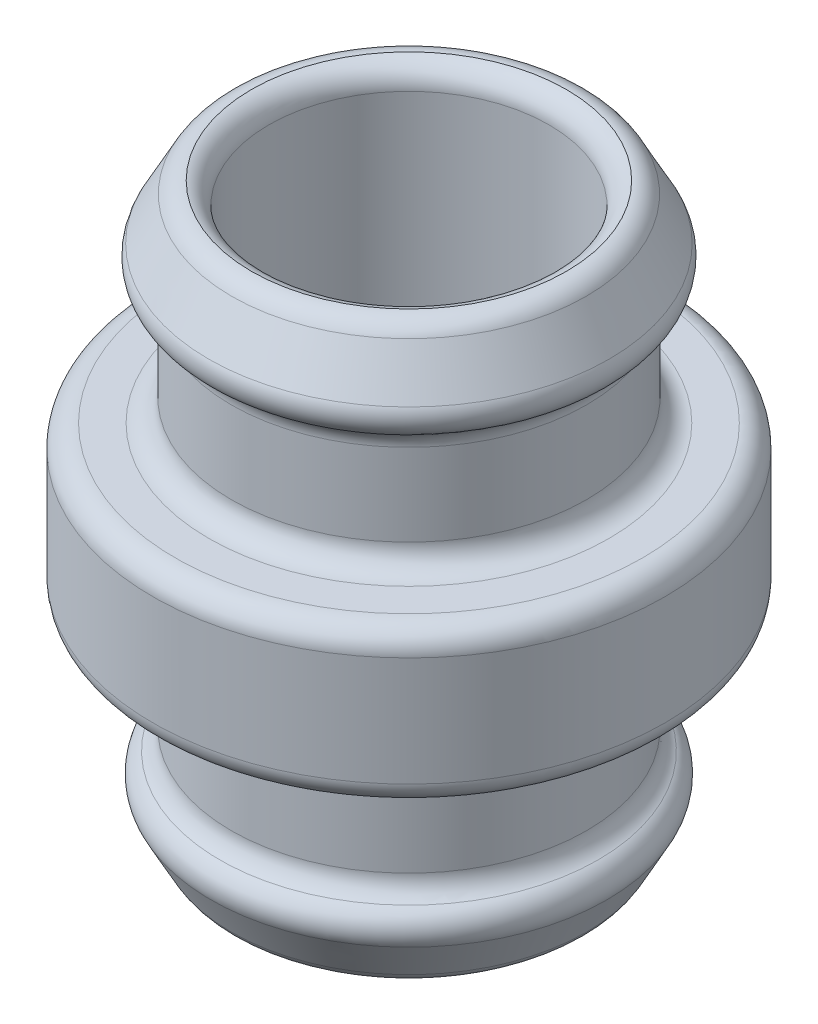
ISO-10303-21;
HEADER;
FILE_DESCRIPTION(('STEP AP214'),'2;1');
FILE_NAME('part.step','',(''),(''),'','','');
FILE_SCHEMA(('AUTOMOTIVE_DESIGN { 1 0 10303 214 1 1 1 1 }'));
ENDSEC;
DATA;
#1=APPLICATION_CONTEXT('core data for automotive mechanical design processes');
#2=APPLICATION_PROTOCOL_DEFINITION('international standard','automotive_design',2000,#1);
#3=PRODUCT_CONTEXT('',#1,'mechanical');
#4=PRODUCT('Part','Part','',(#3));
#5=PRODUCT_RELATED_PRODUCT_CATEGORY('part','',(#4));
#6=PRODUCT_DEFINITION_FORMATION('','',#4);
#7=PRODUCT_DEFINITION_CONTEXT('part definition',#1,'design');
#8=PRODUCT_DEFINITION('design','',#6,#7);
#9=PRODUCT_DEFINITION_SHAPE('','',#8);
#10=(LENGTH_UNIT() NAMED_UNIT(*) SI_UNIT(.MILLI.,.METRE.));
#11=(NAMED_UNIT(*) PLANE_ANGLE_UNIT() SI_UNIT($,.RADIAN.));
#12=(NAMED_UNIT(*) SI_UNIT($,.STERADIAN.) SOLID_ANGLE_UNIT());
#13=UNCERTAINTY_MEASURE_WITH_UNIT(LENGTH_MEASURE(1.E-05),#10,'distance_accuracy_value','');
#14=(GEOMETRIC_REPRESENTATION_CONTEXT(3) GLOBAL_UNCERTAINTY_ASSIGNED_CONTEXT((#13)) GLOBAL_UNIT_ASSIGNED_CONTEXT((#10,
#11,#12)) REPRESENTATION_CONTEXT('',''));
#15=CARTESIAN_POINT('',(0.,0.,0.));
#16=DIRECTION('',(0.,0.,1.));
#17=DIRECTION('',(1.,0.,0.));
#18=AXIS2_PLACEMENT_3D('',#15,#16,#17);
#19=CARTESIAN_POINT('',(0.,19.7199914383357,0.));
#20=DIRECTION('',(0.,1.,0.));
#21=DIRECTION('',(1.,0.,0.));
#22=AXIS2_PLACEMENT_3D('',#19,#20,#21);
#23=TOROIDAL_SURFACE('',#22,5.8,0.8);
#24=CARTESIAN_POINT('',(0.,20.5,0.));
#25=DIRECTION('',(0.,-1.,0.));
#26=DIRECTION('',(0.,0.,-1.));
#27=AXIS2_PLACEMENT_3D('',#24,#25,#26);
#28=CIRCLE('',#27,5.62227368306753);
#29=CARTESIAN_POINT('',(0.,20.5,-5.62227368306753));
#30=VERTEX_POINT('',#29);
#31=EDGE_CURVE('E27',#30,#30,#28,.T.);
#32=ORIENTED_EDGE('',*,*,#31,.F.);
#33=EDGE_LOOP('',(#32));
#34=FACE_BOUND('',#33,.T.);
#35=CARTESIAN_POINT('',(0.,19.7199914383357,0.));
#36=DIRECTION('',(0.,-1.,0.));
#37=DIRECTION('',(0.,0.,-1.));
#38=AXIS2_PLACEMENT_3D('',#35,#36,#37);
#39=CIRCLE('',#38,5.);
#40=CARTESIAN_POINT('',(0.,19.7199914383357,-5.));
#41=VERTEX_POINT('',#40);
#42=EDGE_CURVE('E9',#41,#41,#39,.T.);
#43=ORIENTED_EDGE('',*,*,#42,.T.);
#44=EDGE_LOOP('',(#43));
#45=FACE_BOUND('',#44,.T.);
#46=ADVANCED_FACE('F14',(#34,#45),#23,.T.);
#47=CARTESIAN_POINT('',(0.,10.85,0.));
#48=DIRECTION('',(0.,1.,0.));
#49=DIRECTION('',(1.,0.,0.));
#50=AXIS2_PLACEMENT_3D('',#47,#48,#49);
#51=CYLINDRICAL_SURFACE('',#50,5.);
#52=CARTESIAN_POINT('',(0.,2.,0.));
#53=DIRECTION('',(0.,1.,0.));
#54=DIRECTION('',(1.,0.,0.));
#55=AXIS2_PLACEMENT_3D('',#52,#53,#54);
#56=CIRCLE('',#55,5.);
#57=CARTESIAN_POINT('',(5.,2.,0.));
#58=VERTEX_POINT('',#57);
#59=EDGE_CURVE('E31',#58,#58,#56,.T.);
#60=ORIENTED_EDGE('',*,*,#59,.F.);
#61=EDGE_LOOP('',(#60));
#62=FACE_BOUND('',#61,.T.);
#63=ORIENTED_EDGE('',*,*,#42,.F.);
#64=EDGE_LOOP('',(#63));
#65=FACE_BOUND('',#64,.T.);
#66=ADVANCED_FACE('F101',(#62,#65),#51,.F.);
#67=CARTESIAN_POINT('',(0.,19.7,0.));
#68=DIRECTION('',(0.,1.,0.));
#69=DIRECTION('',(1.,0.,0.));
#70=AXIS2_PLACEMENT_3D('',#67,#68,#69);
#71=TOROIDAL_SURFACE('',#70,5.62227368306753,0.8);
#72=CARTESIAN_POINT('',(0.,20.079421263526,0.));
#73=DIRECTION('',(0.,1.,0.));
#74=DIRECTION('',(1.,0.,0.));
#75=AXIS2_PLACEMENT_3D('',#72,#73,#74);
#76=CIRCLE('',#75,6.32657440348768);
#77=CARTESIAN_POINT('',(6.32657440348767,20.079421263526,0.));
#78=VERTEX_POINT('',#77);
#79=EDGE_CURVE('E22',#78,#78,#76,.T.);
#80=ORIENTED_EDGE('',*,*,#79,.T.);
#81=EDGE_LOOP('',(#80));
#82=FACE_BOUND('',#81,.T.);
#83=ORIENTED_EDGE('',*,*,#31,.T.);
#84=EDGE_LOOP('',(#83));
#85=FACE_BOUND('',#84,.T.);
#86=ADVANCED_FACE('F107',(#82,#85),#71,.T.);
#87=CARTESIAN_POINT('',(0.,19.015,0.));
#88=DIRECTION('',(0.,-1.,0.));
#89=DIRECTION('',(1.,0.,0.));
#90=AXIS2_PLACEMENT_3D('',#87,#88,#89);
#91=CONICAL_SURFACE('',#90,6.90000000000001,0.494142131815903);
#92=CARTESIAN_POINT('',(0.,18.5509312896395,0.));
#93=DIRECTION('',(0.,-1.,0.));
#94=DIRECTION('',(0.,0.,-1.));
#95=AXIS2_PLACEMENT_3D('',#92,#93,#94);
#96=CIRCLE('',#95,7.15000334564879);
#97=CARTESIAN_POINT('',(0.,18.5509312896395,-7.15000334564879));
#98=VERTEX_POINT('',#97);
#99=EDGE_CURVE('E33',#98,#98,#96,.T.);
#100=ORIENTED_EDGE('',*,*,#99,.F.);
#101=EDGE_LOOP('',(#100));
#102=FACE_BOUND('',#101,.T.);
#103=ORIENTED_EDGE('',*,*,#79,.F.);
#104=EDGE_LOOP('',(#103));
#105=FACE_BOUND('',#104,.T.);
#106=ADVANCED_FACE('F114',(#102,#105),#91,.T.);
#107=CARTESIAN_POINT('',(0.,18.1715100261134,0.));
#108=DIRECTION('',(0.,-1.,0.));
#109=DIRECTION('',(0.,0.,-1.));
#110=AXIS2_PLACEMENT_3D('',#107,#108,#109);
#111=TOROIDAL_SURFACE('',#110,6.44570262522865,0.8);
#112=CARTESIAN_POINT('',(0.,17.4507550130567,0.));
#113=DIRECTION('',(0.,1.,0.));
#114=DIRECTION('',(1.,0.,0.));
#115=AXIS2_PLACEMENT_3D('',#112,#113,#114);
#116=CIRCLE('',#115,6.79285131261433);
#117=CARTESIAN_POINT('',(6.79285131261433,17.4507550130567,0.));
#118=VERTEX_POINT('',#117);
#119=EDGE_CURVE('E38',#118,#118,#116,.T.);
#120=ORIENTED_EDGE('',*,*,#119,.T.);
#121=EDGE_LOOP('',(#120));
#122=FACE_BOUND('',#121,.T.);
#123=ORIENTED_EDGE('',*,*,#99,.T.);
#124=EDGE_LOOP('',(#123));
#125=FACE_BOUND('',#124,.T.);
#126=ADVANCED_FACE('F116',(#122,#125),#111,.T.);
#127=CARTESIAN_POINT('',(0.,2.,0.));
#128=DIRECTION('',(0.,1.,0.));
#129=DIRECTION('',(1.,0.,0.));
#130=AXIS2_PLACEMENT_3D('',#127,#128,#129);
#131=TOROIDAL_SURFACE('',#130,4.2,0.8);
#132=ORIENTED_EDGE('',*,*,#59,.T.);
#133=EDGE_LOOP('',(#132));
#134=FACE_BOUND('',#133,.T.);
#135=CARTESIAN_POINT('',(0.,1.2,0.));
#136=DIRECTION('',(0.,-1.,0.));
#137=DIRECTION('',(0.,0.,-1.));
#138=AXIS2_PLACEMENT_3D('',#135,#136,#137);
#139=CIRCLE('',#138,4.2);
#140=CARTESIAN_POINT('',(0.,1.2,-4.2));
#141=VERTEX_POINT('',#140);
#142=EDGE_CURVE('E34',#141,#141,#139,.T.);
#143=ORIENTED_EDGE('',*,*,#142,.T.);
#144=EDGE_LOOP('',(#143));
#145=FACE_BOUND('',#144,.T.);
#146=ADVANCED_FACE('F119',(#134,#145),#131,.F.);
#147=CARTESIAN_POINT('',(0.,1.2,0.));
#148=DIRECTION('',(0.,1.,0.));
#149=DIRECTION('',(0.,0.,1.));
#150=AXIS2_PLACEMENT_3D('',#147,#148,#149);
#151=PLANE('',#150);
#152=ORIENTED_EDGE('',*,*,#142,.F.);
#153=EDGE_LOOP('',(#152));
#154=FACE_BOUND('',#153,.T.);
#155=ADVANCED_FACE('F123',(#154),#151,.T.);
#156=CARTESIAN_POINT('',(0.,3.56717585794084,0.));
#157=DIRECTION('',(0.,1.,0.));
#158=DIRECTION('',(1.,0.,0.));
#159=AXIS2_PLACEMENT_3D('',#156,#157,#158);
#160=TOROIDAL_SURFACE('',#159,7.14,0.8);
#161=CARTESIAN_POINT('',(0.,2.86858792897042,0.));
#162=DIRECTION('',(0.,1.,0.));
#163=DIRECTION('',(1.,0.,0.));
#164=AXIS2_PLACEMENT_3D('',#161,#162,#163);
#165=CIRCLE('',#164,6.75016041055734);
#166=CARTESIAN_POINT('',(6.75016041055734,2.86858792897042,0.));
#167=VERTEX_POINT('',#166);
#168=EDGE_CURVE('E43',#167,#167,#165,.T.);
#169=ORIENTED_EDGE('',*,*,#168,.T.);
#170=EDGE_LOOP('',(#169));
#171=FACE_BOUND('',#170,.T.);
#172=CARTESIAN_POINT('',(0.,3.56717585794084,0.));
#173=DIRECTION('',(0.,-1.,0.));
#174=DIRECTION('',(0.,0.,-1.));
#175=AXIS2_PLACEMENT_3D('',#172,#173,#174);
#176=CIRCLE('',#175,6.34);
#177=CARTESIAN_POINT('',(0.,3.56717585794084,-6.34));
#178=VERTEX_POINT('',#177);
#179=EDGE_CURVE('E46',#178,#178,#176,.T.);
#180=ORIENTED_EDGE('',*,*,#179,.T.);
#181=EDGE_LOOP('',(#180));
#182=FACE_BOUND('',#181,.T.);
#183=ADVANCED_FACE('F127',(#171,#182),#160,.F.);
#184=CARTESIAN_POINT('',(0.,5.23500000000001,0.));
#185=DIRECTION('',(0.,1.,0.));
#186=DIRECTION('',(1.,0.,0.));
#187=AXIS2_PLACEMENT_3D('',#184,#185,#186);
#188=CYLINDRICAL_SURFACE('',#187,6.34);
#189=CARTESIAN_POINT('',(0.,6.70000000000001,0.));
#190=DIRECTION('',(0.,1.,0.));
#191=DIRECTION('',(1.,0.,0.));
#192=AXIS2_PLACEMENT_3D('',#189,#190,#191);
#193=CIRCLE('',#192,6.34);
#194=CARTESIAN_POINT('',(6.34,6.70000000000001,0.));
#195=VERTEX_POINT('',#194);
#196=EDGE_CURVE('E50',#195,#195,#193,.T.);
#197=ORIENTED_EDGE('',*,*,#196,.F.);
#198=EDGE_LOOP('',(#197));
#199=FACE_BOUND('',#198,.T.);
#200=ORIENTED_EDGE('',*,*,#179,.F.);
#201=EDGE_LOOP('',(#200));
#202=FACE_BOUND('',#201,.T.);
#203=ADVANCED_FACE('F131',(#199,#202),#188,.T.);
#204=CARTESIAN_POINT('',(0.,2.17000000000001,0.));
#205=DIRECTION('',(0.,1.,0.));
#206=DIRECTION('',(1.,0.,0.));
#207=AXIS2_PLACEMENT_3D('',#204,#205,#206);
#208=TOROIDAL_SURFACE('',#207,6.36032082111467,0.8);
#209=CARTESIAN_POINT('',(0.,1.79057873647401,0.));
#210=DIRECTION('',(0.,1.,0.));
#211=DIRECTION('',(1.,0.,0.));
#212=AXIS2_PLACEMENT_3D('',#209,#210,#211);
#213=CIRCLE('',#212,7.06462154153482);
#214=CARTESIAN_POINT('',(7.06462154153482,1.79057873647401,0.));
#215=VERTEX_POINT('',#214);
#216=EDGE_CURVE('E49',#215,#215,#213,.T.);
#217=ORIENTED_EDGE('',*,*,#216,.T.);
#218=EDGE_LOOP('',(#217));
#219=FACE_BOUND('',#218,.T.);
#220=ORIENTED_EDGE('',*,*,#168,.F.);
#221=EDGE_LOOP('',(#220));
#222=FACE_BOUND('',#221,.T.);
#223=ADVANCED_FACE('F133',(#219,#222),#208,.T.);
#224=CARTESIAN_POINT('',(0.,1.485,0.));
#225=DIRECTION('',(0.,1.,0.));
#226=DIRECTION('',(1.,0.,0.));
#227=AXIS2_PLACEMENT_3D('',#224,#225,#226);
#228=CONICAL_SURFACE('',#227,6.9,0.494142131815899);
#229=CARTESIAN_POINT('',(0.,0.420578736473998,0.));
#230=DIRECTION('',(0.,-1.,0.));
#231=DIRECTION('',(0.,0.,-1.));
#232=AXIS2_PLACEMENT_3D('',#229,#230,#231);
#233=CIRCLE('',#232,6.32657440348768);
#234=CARTESIAN_POINT('',(0.,0.420578736473998,-6.32657440348768));
#235=VERTEX_POINT('',#234);
#236=EDGE_CURVE('E58',#235,#235,#233,.T.);
#237=ORIENTED_EDGE('',*,*,#236,.F.);
#238=EDGE_LOOP('',(#237));
#239=FACE_BOUND('',#238,.T.);
#240=ORIENTED_EDGE('',*,*,#216,.F.);
#241=EDGE_LOOP('',(#240));
#242=FACE_BOUND('',#241,.T.);
#243=ADVANCED_FACE('F136',(#239,#242),#228,.T.);
#244=CARTESIAN_POINT('',(0.,0.8,0.));
#245=DIRECTION('',(0.,1.,0.));
#246=DIRECTION('',(1.,0.,0.));
#247=AXIS2_PLACEMENT_3D('',#244,#245,#246);
#248=TOROIDAL_SURFACE('',#247,5.62227368306753,0.8);
#249=CARTESIAN_POINT('',(0.,0.,0.));
#250=DIRECTION('',(0.,1.,0.));
#251=DIRECTION('',(1.,0.,0.));
#252=AXIS2_PLACEMENT_3D('',#249,#250,#251);
#253=CIRCLE('',#252,5.62227368306753);
#254=CARTESIAN_POINT('',(5.62227368306753,0.,0.));
#255=VERTEX_POINT('',#254);
#256=EDGE_CURVE('E57',#255,#255,#253,.T.);
#257=ORIENTED_EDGE('',*,*,#256,.T.);
#258=EDGE_LOOP('',(#257));
#259=FACE_BOUND('',#258,.T.);
#260=ORIENTED_EDGE('',*,*,#236,.T.);
#261=EDGE_LOOP('',(#260));
#262=FACE_BOUND('',#261,.T.);
#263=ADVANCED_FACE('F138',(#259,#262),#248,.T.);
#264=CARTESIAN_POINT('',(0.,0.,6.1));
#265=DIRECTION('',(0.,-1.,0.));
#266=DIRECTION('',(0.,0.,-1.));
#267=AXIS2_PLACEMENT_3D('',#264,#265,#266);
#268=PLANE('',#267);
#269=ORIENTED_EDGE('',*,*,#256,.F.);
#270=EDGE_LOOP('',(#269));
#271=FACE_BOUND('',#270,.T.);
#272=ADVANCED_FACE('F141',(#271),#268,.T.);
#273=CARTESIAN_POINT('',(0.,8.30000000000001,0.));
#274=DIRECTION('',(0.,1.,0.));
#275=DIRECTION('',(1.,0.,0.));
#276=AXIS2_PLACEMENT_3D('',#273,#274,#275);
#277=TOROIDAL_SURFACE('',#276,8.34,0.8);
#278=CARTESIAN_POINT('',(0.,7.50000000000001,0.));
#279=DIRECTION('',(0.,1.,0.));
#280=DIRECTION('',(1.,0.,0.));
#281=AXIS2_PLACEMENT_3D('',#278,#279,#280);
#282=CIRCLE('',#281,8.34);
#283=CARTESIAN_POINT('',(8.34,7.50000000000001,0.));
#284=VERTEX_POINT('',#283);
#285=EDGE_CURVE('E61',#284,#284,#282,.T.);
#286=ORIENTED_EDGE('',*,*,#285,.T.);
#287=EDGE_LOOP('',(#286));
#288=FACE_BOUND('',#287,.T.);
#289=CARTESIAN_POINT('',(0.,8.30000000000001,0.));
#290=DIRECTION('',(0.,-1.,0.));
#291=DIRECTION('',(0.,0.,-1.));
#292=AXIS2_PLACEMENT_3D('',#289,#290,#291);
#293=CIRCLE('',#292,9.14);
#294=CARTESIAN_POINT('',(0.,8.30000000000001,-9.14));
#295=VERTEX_POINT('',#294);
#296=EDGE_CURVE('E53',#295,#295,#293,.T.);
#297=ORIENTED_EDGE('',*,*,#296,.T.);
#298=EDGE_LOOP('',(#297));
#299=FACE_BOUND('',#298,.T.);
#300=ADVANCED_FACE('F145',(#288,#299),#277,.T.);
#301=CARTESIAN_POINT('',(0.,7.50000000000001,9.14));
#302=DIRECTION('',(0.,-1.,0.));
#303=DIRECTION('',(0.,0.,-1.));
#304=AXIS2_PLACEMENT_3D('',#301,#302,#303);
#305=PLANE('',#304);
#306=CARTESIAN_POINT('',(0.,7.50000000000001,0.));
#307=DIRECTION('',(0.,-1.,0.));
#308=DIRECTION('',(0.,0.,-1.));
#309=AXIS2_PLACEMENT_3D('',#306,#307,#308);
#310=CIRCLE('',#309,7.14);
#311=CARTESIAN_POINT('',(0.,7.50000000000001,-7.14));
#312=VERTEX_POINT('',#311);
#313=EDGE_CURVE('E54',#312,#312,#310,.T.);
#314=ORIENTED_EDGE('',*,*,#313,.F.);
#315=EDGE_LOOP('',(#314));
#316=FACE_BOUND('',#315,.T.);
#317=ORIENTED_EDGE('',*,*,#285,.F.);
#318=EDGE_LOOP('',(#317));
#319=FACE_BOUND('',#318,.T.);
#320=ADVANCED_FACE('F149',(#316,#319),#305,.T.);
#321=CARTESIAN_POINT('',(0.,10.25,0.));
#322=DIRECTION('',(0.,1.,0.));
#323=DIRECTION('',(1.,0.,0.));
#324=AXIS2_PLACEMENT_3D('',#321,#322,#323);
#325=CYLINDRICAL_SURFACE('',#324,9.14);
#326=CARTESIAN_POINT('',(0.,12.2,0.));
#327=DIRECTION('',(0.,1.,0.));
#328=DIRECTION('',(1.,0.,0.));
#329=AXIS2_PLACEMENT_3D('',#326,#327,#328);
#330=CIRCLE('',#329,9.14);
#331=CARTESIAN_POINT('',(9.14,12.2,0.));
#332=VERTEX_POINT('',#331);
#333=EDGE_CURVE('E70',#332,#332,#330,.T.);
#334=ORIENTED_EDGE('',*,*,#333,.F.);
#335=EDGE_LOOP('',(#334));
#336=FACE_BOUND('',#335,.T.);
#337=ORIENTED_EDGE('',*,*,#296,.F.);
#338=EDGE_LOOP('',(#337));
#339=FACE_BOUND('',#338,.T.);
#340=ADVANCED_FACE('F16',(#336,#339),#325,.T.);
#341=CARTESIAN_POINT('',(0.,6.70000000000001,0.));
#342=DIRECTION('',(0.,1.,0.));
#343=DIRECTION('',(1.,0.,0.));
#344=AXIS2_PLACEMENT_3D('',#341,#342,#343);
#345=TOROIDAL_SURFACE('',#344,7.14,0.8);
#346=ORIENTED_EDGE('',*,*,#196,.T.);
#347=EDGE_LOOP('',(#346));
#348=FACE_BOUND('',#347,.T.);
#349=ORIENTED_EDGE('',*,*,#313,.T.);
#350=EDGE_LOOP('',(#349));
#351=FACE_BOUND('',#350,.T.);
#352=ADVANCED_FACE('F154',(#348,#351),#345,.F.);
#353=CARTESIAN_POINT('',(0.,12.2,0.));
#354=DIRECTION('',(0.,1.,0.));
#355=DIRECTION('',(1.,0.,0.));
#356=AXIS2_PLACEMENT_3D('',#353,#354,#355);
#357=TOROIDAL_SURFACE('',#356,8.34,0.8);
#358=ORIENTED_EDGE('',*,*,#333,.T.);
#359=EDGE_LOOP('',(#358));
#360=FACE_BOUND('',#359,.T.);
#361=CARTESIAN_POINT('',(0.,13.,0.));
#362=DIRECTION('',(0.,-1.,0.));
#363=DIRECTION('',(0.,0.,-1.));
#364=AXIS2_PLACEMENT_3D('',#361,#362,#363);
#365=CIRCLE('',#364,8.34);
#366=CARTESIAN_POINT('',(0.,13.,-8.34));
#367=VERTEX_POINT('',#366);
#368=EDGE_CURVE('E73',#367,#367,#365,.T.);
#369=ORIENTED_EDGE('',*,*,#368,.T.);
#370=EDGE_LOOP('',(#369));
#371=FACE_BOUND('',#370,.T.);
#372=ADVANCED_FACE('F157',(#360,#371),#357,.T.);
#373=CARTESIAN_POINT('',(0.,13.,6.34000000000001));
#374=DIRECTION('',(0.,1.,0.));
#375=DIRECTION('',(0.,0.,1.));
#376=AXIS2_PLACEMENT_3D('',#373,#374,#375);
#377=PLANE('',#376);
#378=CARTESIAN_POINT('',(0.,13.,0.));
#379=DIRECTION('',(0.,1.,0.));
#380=DIRECTION('',(1.,0.,0.));
#381=AXIS2_PLACEMENT_3D('',#378,#379,#380);
#382=CIRCLE('',#381,7.14000000000001);
#383=CARTESIAN_POINT('',(7.14000000000001,13.,0.));
#384=VERTEX_POINT('',#383);
#385=EDGE_CURVE('E77',#384,#384,#382,.T.);
#386=ORIENTED_EDGE('',*,*,#385,.F.);
#387=EDGE_LOOP('',(#386));
#388=FACE_BOUND('',#387,.T.);
#389=ORIENTED_EDGE('',*,*,#368,.F.);
#390=EDGE_LOOP('',(#389));
#391=FACE_BOUND('',#390,.T.);
#392=ADVANCED_FACE('F95',(#388,#391),#377,.T.);
#393=CARTESIAN_POINT('',(0.,16.73,0.));
#394=DIRECTION('',(0.,1.,0.));
#395=DIRECTION('',(1.,0.,0.));
#396=AXIS2_PLACEMENT_3D('',#393,#394,#395);
#397=TOROIDAL_SURFACE('',#396,7.14000000000001,0.8);
#398=ORIENTED_EDGE('',*,*,#119,.F.);
#399=EDGE_LOOP('',(#398));
#400=FACE_BOUND('',#399,.T.);
#401=CARTESIAN_POINT('',(0.,16.73,0.));
#402=DIRECTION('',(0.,1.,0.));
#403=DIRECTION('',(1.,0.,0.));
#404=AXIS2_PLACEMENT_3D('',#401,#402,#403);
#405=CIRCLE('',#404,6.34000000000001);
#406=CARTESIAN_POINT('',(6.34000000000001,16.73,0.));
#407=VERTEX_POINT('',#406);
#408=EDGE_CURVE('E76',#407,#407,#405,.T.);
#409=ORIENTED_EDGE('',*,*,#408,.T.);
#410=EDGE_LOOP('',(#409));
#411=FACE_BOUND('',#410,.T.);
#412=ADVANCED_FACE('F82',(#400,#411),#397,.F.);
#413=CARTESIAN_POINT('',(0.,15.265,0.));
#414=DIRECTION('',(0.,1.,0.));
#415=DIRECTION('',(1.,0.,0.));
#416=AXIS2_PLACEMENT_3D('',#413,#414,#415);
#417=CYLINDRICAL_SURFACE('',#416,6.34000000000001);
#418=CARTESIAN_POINT('',(0.,13.8,0.));
#419=DIRECTION('',(0.,-1.,0.));
#420=DIRECTION('',(0.,0.,-1.));
#421=AXIS2_PLACEMENT_3D('',#418,#419,#420);
#422=CIRCLE('',#421,6.34000000000001);
#423=CARTESIAN_POINT('',(0.,13.8,-6.34000000000001));
#424=VERTEX_POINT('',#423);
#425=EDGE_CURVE('E18',#424,#424,#422,.T.);
#426=ORIENTED_EDGE('',*,*,#425,.F.);
#427=EDGE_LOOP('',(#426));
#428=FACE_BOUND('',#427,.T.);
#429=ORIENTED_EDGE('',*,*,#408,.F.);
#430=EDGE_LOOP('',(#429));
#431=FACE_BOUND('',#430,.T.);
#432=ADVANCED_FACE('F84',(#428,#431),#417,.T.);
#433=CARTESIAN_POINT('',(0.,13.8,0.));
#434=DIRECTION('',(0.,1.,0.));
#435=DIRECTION('',(1.,0.,0.));
#436=AXIS2_PLACEMENT_3D('',#433,#434,#435);
#437=TOROIDAL_SURFACE('',#436,7.14000000000001,0.8);
#438=ORIENTED_EDGE('',*,*,#385,.T.);
#439=EDGE_LOOP('',(#438));
#440=FACE_BOUND('',#439,.T.);
#441=ORIENTED_EDGE('',*,*,#425,.T.);
#442=EDGE_LOOP('',(#441));
#443=FACE_BOUND('',#442,.T.);
#444=ADVANCED_FACE('F86',(#440,#443),#437,.F.);
#445=CLOSED_SHELL('',(#46,#66,#86,#106,#126,#146,#155,#183,#203,#223,#243,#263,#272,#300,#320,
#340,#352,#372,#392,#412,#432,#444));
#446=MANIFOLD_SOLID_BREP('B1',#445);
#447=ADVANCED_BREP_SHAPE_REPRESENTATION('',(#18,#446),#14);
#448=SHAPE_DEFINITION_REPRESENTATION(#9,#447);
ENDSEC;
END-ISO-10303-21;
